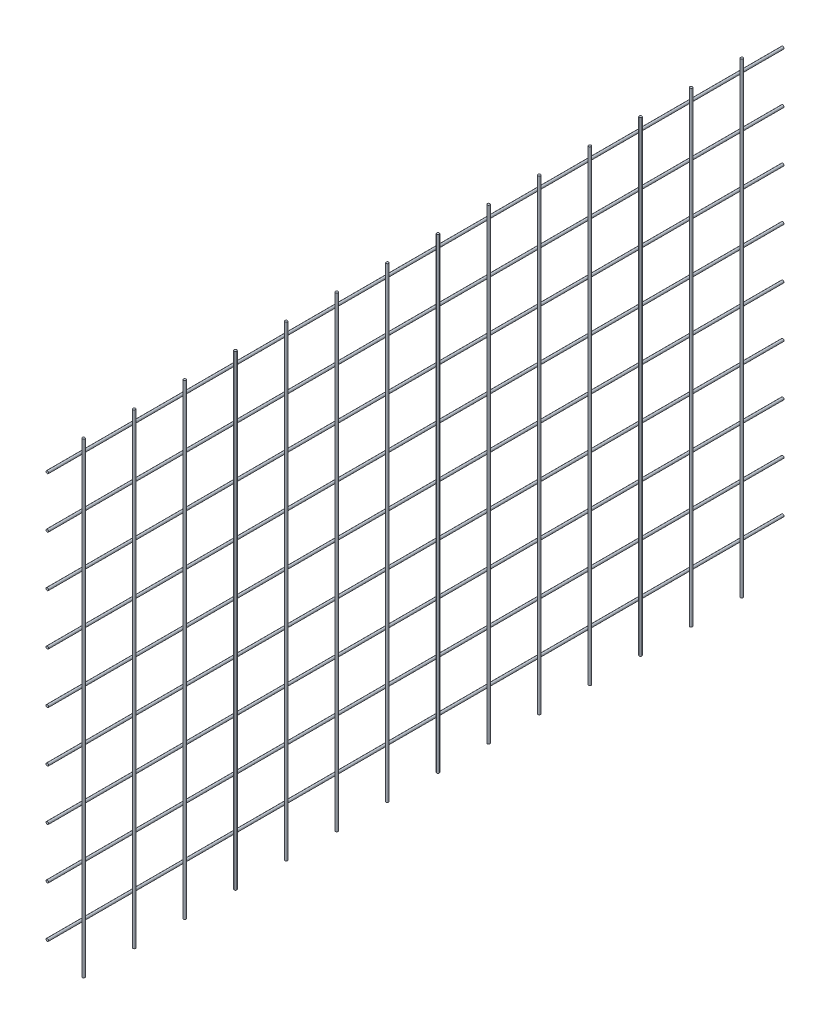
ISO-10303-21;
HEADER;
FILE_DESCRIPTION(('STEP AP214'),'2;1');
FILE_NAME('part.step','',(''),(''),'','','');
FILE_SCHEMA(('AUTOMOTIVE_DESIGN { 1 0 10303 214 1 1 1 1 }'));
ENDSEC;
DATA;
#1=APPLICATION_CONTEXT('core data for automotive mechanical design processes');
#2=APPLICATION_PROTOCOL_DEFINITION('international standard','automotive_design',2000,#1);
#3=PRODUCT_CONTEXT('',#1,'mechanical');
#4=PRODUCT('Part','Part','',(#3));
#5=PRODUCT_RELATED_PRODUCT_CATEGORY('part','',(#4));
#6=PRODUCT_DEFINITION_FORMATION('','',#4);
#7=PRODUCT_DEFINITION_CONTEXT('part definition',#1,'design');
#8=PRODUCT_DEFINITION('design','',#6,#7);
#9=PRODUCT_DEFINITION_SHAPE('','',#8);
#10=(LENGTH_UNIT() NAMED_UNIT(*) SI_UNIT(.MILLI.,.METRE.));
#11=(NAMED_UNIT(*) PLANE_ANGLE_UNIT() SI_UNIT($,.RADIAN.));
#12=(NAMED_UNIT(*) SI_UNIT($,.STERADIAN.) SOLID_ANGLE_UNIT());
#13=UNCERTAINTY_MEASURE_WITH_UNIT(LENGTH_MEASURE(1.E-05),#10,'distance_accuracy_value','');
#14=(GEOMETRIC_REPRESENTATION_CONTEXT(3) GLOBAL_UNCERTAINTY_ASSIGNED_CONTEXT((#13)) GLOBAL_UNIT_ASSIGNED_CONTEXT((#10,
#11,#12)) REPRESENTATION_CONTEXT('',''));
#15=CARTESIAN_POINT('',(0.,0.,0.));
#16=DIRECTION('',(0.,0.,1.));
#17=DIRECTION('',(1.,0.,0.));
#18=AXIS2_PLACEMENT_3D('',#15,#16,#17);
#19=CARTESIAN_POINT('',(-20.0100000000104,703.5,-891.500000000004));
#20=DIRECTION('',(0.,0.,-1.));
#21=DIRECTION('',(-1.,0.,0.));
#22=AXIS2_PLACEMENT_3D('',#19,#20,#21);
#23=PLANE('',#22);
#24=CARTESIAN_POINT('',(0.,760.,-891.500000000004));
#25=DIRECTION('',(0.,0.,-1.));
#26=DIRECTION('',(-1.,0.,0.));
#27=AXIS2_PLACEMENT_3D('',#24,#25,#26);
#28=CIRCLE('',#27,1.49999999999986);
#29=CARTESIAN_POINT('',(-1.49999999999985,760.,-891.500000000004));
#30=VERTEX_POINT('',#29);
#31=EDGE_CURVE('E56',#30,#30,#28,.T.);
#32=ORIENTED_EDGE('',*,*,#31,.T.);
#33=EDGE_LOOP('',(#32));
#34=FACE_BOUND('',#33,.T.);
#35=ADVANCED_FACE('F52',(#34),#23,.T.);
#36=CARTESIAN_POINT('',(0.,760.,-20.));
#37=DIRECTION('',(0.,0.,-1.));
#38=DIRECTION('',(-1.,0.,0.));
#39=AXIS2_PLACEMENT_3D('',#36,#37,#38);
#40=PLANE('',#39);
#41=CARTESIAN_POINT('',(0.,760.,-20.));
#42=DIRECTION('',(0.,0.,-1.));
#43=DIRECTION('',(-1.,0.,0.));
#44=AXIS2_PLACEMENT_3D('',#41,#42,#43);
#45=CIRCLE('',#44,1.49999999999986);
#46=CARTESIAN_POINT('',(-1.49999999999985,760.,-20.));
#47=VERTEX_POINT('',#46);
#48=EDGE_CURVE('E11',#47,#47,#45,.T.);
#49=ORIENTED_EDGE('',*,*,#48,.F.);
#50=EDGE_LOOP('',(#49));
#51=FACE_BOUND('',#50,.T.);
#52=ADVANCED_FACE('F71',(#51),#40,.F.);
#53=CARTESIAN_POINT('',(0.,760.,-3080.002));
#54=DIRECTION('',(0.,0.,1.));
#55=DIRECTION('',(1.,0.,0.));
#56=AXIS2_PLACEMENT_3D('',#53,#54,#55);
#57=CYLINDRICAL_SURFACE('',#56,1.49999999999986);
#58=ORIENTED_EDGE('',*,*,#48,.T.);
#59=EDGE_LOOP('',(#58));
#60=FACE_BOUND('',#59,.T.);
#61=ORIENTED_EDGE('',*,*,#31,.F.);
#62=EDGE_LOOP('',(#61));
#63=FACE_BOUND('',#62,.T.);
#64=ADVANCED_FACE('F54',(#60,#63),#57,.T.);
#65=CLOSED_SHELL('',(#35,#52,#64));
#66=MANIFOLD_SOLID_BREP('B2',#65);
#67=CARTESIAN_POINT('',(-20.0100000000104,703.5,-891.500000000004));
#68=DIRECTION('',(0.,0.,-1.));
#69=DIRECTION('',(-1.,0.,0.));
#70=AXIS2_PLACEMENT_3D('',#67,#68,#69);
#71=PLANE('',#70);
#72=CARTESIAN_POINT('',(-1.06451306103317E-11,820.,-891.500000000004));
#73=DIRECTION('',(0.,0.,-1.));
#74=DIRECTION('',(-1.,0.,0.));
#75=AXIS2_PLACEMENT_3D('',#72,#73,#74);
#76=CIRCLE('',#75,1.49999999999986);
#77=CARTESIAN_POINT('',(-1.50000000001051,820.,-891.500000000004));
#78=VERTEX_POINT('',#77);
#79=EDGE_CURVE('E103',#78,#78,#76,.T.);
#80=ORIENTED_EDGE('',*,*,#79,.T.);
#81=EDGE_LOOP('',(#80));
#82=FACE_BOUND('',#81,.T.);
#83=ADVANCED_FACE('F99',(#82),#71,.T.);
#84=CARTESIAN_POINT('',(-1.06451306103317E-11,820.,-20.));
#85=DIRECTION('',(0.,0.,-1.));
#86=DIRECTION('',(-1.,0.,0.));
#87=AXIS2_PLACEMENT_3D('',#84,#85,#86);
#88=PLANE('',#87);
#89=CARTESIAN_POINT('',(-1.06451306103317E-11,820.,-20.));
#90=DIRECTION('',(0.,0.,-1.));
#91=DIRECTION('',(-1.,0.,0.));
#92=AXIS2_PLACEMENT_3D('',#89,#90,#91);
#93=CIRCLE('',#92,1.49999999999986);
#94=CARTESIAN_POINT('',(-1.50000000001051,820.,-20.));
#95=VERTEX_POINT('',#94);
#96=EDGE_CURVE('E51',#95,#95,#93,.T.);
#97=ORIENTED_EDGE('',*,*,#96,.F.);
#98=EDGE_LOOP('',(#97));
#99=FACE_BOUND('',#98,.T.);
#100=ADVANCED_FACE('F118',(#99),#88,.F.);
#101=CARTESIAN_POINT('',(0.,820.,-3080.002));
#102=DIRECTION('',(0.,0.,1.));
#103=DIRECTION('',(1.,0.,0.));
#104=AXIS2_PLACEMENT_3D('',#101,#102,#103);
#105=CYLINDRICAL_SURFACE('',#104,1.49999999999986);
#106=ORIENTED_EDGE('',*,*,#96,.T.);
#107=EDGE_LOOP('',(#106));
#108=FACE_BOUND('',#107,.T.);
#109=ORIENTED_EDGE('',*,*,#79,.F.);
#110=EDGE_LOOP('',(#109));
#111=FACE_BOUND('',#110,.T.);
#112=ADVANCED_FACE('F101',(#108,#111),#105,.T.);
#113=CLOSED_SHELL('',(#83,#100,#112));
#114=MANIFOLD_SOLID_BREP('B6',#113);
#115=CARTESIAN_POINT('',(-20.0100000000104,703.5,-891.500000000004));
#116=DIRECTION('',(0.,0.,-1.));
#117=DIRECTION('',(-1.,0.,0.));
#118=AXIS2_PLACEMENT_3D('',#115,#116,#117);
#119=PLANE('',#118);
#120=CARTESIAN_POINT('',(0.,880.,-891.500000000004));
#121=DIRECTION('',(0.,0.,-1.));
#122=DIRECTION('',(-1.,0.,0.));
#123=AXIS2_PLACEMENT_3D('',#120,#121,#122);
#124=CIRCLE('',#123,1.49999999999986);
#125=CARTESIAN_POINT('',(-1.49999999999985,880.,-891.500000000004));
#126=VERTEX_POINT('',#125);
#127=EDGE_CURVE('E150',#126,#126,#124,.T.);
#128=ORIENTED_EDGE('',*,*,#127,.T.);
#129=EDGE_LOOP('',(#128));
#130=FACE_BOUND('',#129,.T.);
#131=ADVANCED_FACE('F146',(#130),#119,.T.);
#132=CARTESIAN_POINT('',(0.,880.,-20.));
#133=DIRECTION('',(0.,0.,-1.));
#134=DIRECTION('',(-1.,0.,0.));
#135=AXIS2_PLACEMENT_3D('',#132,#133,#134);
#136=PLANE('',#135);
#137=CARTESIAN_POINT('',(0.,880.,-20.));
#138=DIRECTION('',(0.,0.,-1.));
#139=DIRECTION('',(-1.,0.,0.));
#140=AXIS2_PLACEMENT_3D('',#137,#138,#139);
#141=CIRCLE('',#140,1.49999999999986);
#142=CARTESIAN_POINT('',(-1.49999999999985,880.,-20.));
#143=VERTEX_POINT('',#142);
#144=EDGE_CURVE('E98',#143,#143,#141,.T.);
#145=ORIENTED_EDGE('',*,*,#144,.F.);
#146=EDGE_LOOP('',(#145));
#147=FACE_BOUND('',#146,.T.);
#148=ADVANCED_FACE('F165',(#147),#136,.F.);
#149=CARTESIAN_POINT('',(0.,880.,-3080.002));
#150=DIRECTION('',(0.,0.,1.));
#151=DIRECTION('',(1.,0.,0.));
#152=AXIS2_PLACEMENT_3D('',#149,#150,#151);
#153=CYLINDRICAL_SURFACE('',#152,1.49999999999986);
#154=ORIENTED_EDGE('',*,*,#144,.T.);
#155=EDGE_LOOP('',(#154));
#156=FACE_BOUND('',#155,.T.);
#157=ORIENTED_EDGE('',*,*,#127,.F.);
#158=EDGE_LOOP('',(#157));
#159=FACE_BOUND('',#158,.T.);
#160=ADVANCED_FACE('F148',(#156,#159),#153,.T.);
#161=CLOSED_SHELL('',(#131,#148,#160));
#162=MANIFOLD_SOLID_BREP('B46',#161);
#163=CARTESIAN_POINT('',(-20.0100000000104,703.5,-891.500000000004));
#164=DIRECTION('',(0.,0.,-1.));
#165=DIRECTION('',(-1.,0.,0.));
#166=AXIS2_PLACEMENT_3D('',#163,#164,#165);
#167=PLANE('',#166);
#168=CARTESIAN_POINT('',(-1.06451306103317E-11,940.,-891.500000000004));
#169=DIRECTION('',(0.,0.,-1.));
#170=DIRECTION('',(-1.,0.,0.));
#171=AXIS2_PLACEMENT_3D('',#168,#169,#170);
#172=CIRCLE('',#171,1.49999999999986);
#173=CARTESIAN_POINT('',(-1.50000000001051,940.,-891.500000000004));
#174=VERTEX_POINT('',#173);
#175=EDGE_CURVE('E197',#174,#174,#172,.T.);
#176=ORIENTED_EDGE('',*,*,#175,.T.);
#177=EDGE_LOOP('',(#176));
#178=FACE_BOUND('',#177,.T.);
#179=ADVANCED_FACE('F193',(#178),#167,.T.);
#180=CARTESIAN_POINT('',(-1.06451306103317E-11,940.,-20.));
#181=DIRECTION('',(0.,0.,-1.));
#182=DIRECTION('',(-1.,0.,0.));
#183=AXIS2_PLACEMENT_3D('',#180,#181,#182);
#184=PLANE('',#183);
#185=CARTESIAN_POINT('',(-1.06451306103317E-11,940.,-20.));
#186=DIRECTION('',(0.,0.,-1.));
#187=DIRECTION('',(-1.,0.,0.));
#188=AXIS2_PLACEMENT_3D('',#185,#186,#187);
#189=CIRCLE('',#188,1.49999999999986);
#190=CARTESIAN_POINT('',(-1.50000000001051,940.,-20.));
#191=VERTEX_POINT('',#190);
#192=EDGE_CURVE('E145',#191,#191,#189,.T.);
#193=ORIENTED_EDGE('',*,*,#192,.F.);
#194=EDGE_LOOP('',(#193));
#195=FACE_BOUND('',#194,.T.);
#196=ADVANCED_FACE('F212',(#195),#184,.F.);
#197=CARTESIAN_POINT('',(0.,940.,-3080.002));
#198=DIRECTION('',(0.,0.,1.));
#199=DIRECTION('',(1.,0.,0.));
#200=AXIS2_PLACEMENT_3D('',#197,#198,#199);
#201=CYLINDRICAL_SURFACE('',#200,1.49999999999986);
#202=ORIENTED_EDGE('',*,*,#192,.T.);
#203=EDGE_LOOP('',(#202));
#204=FACE_BOUND('',#203,.T.);
#205=ORIENTED_EDGE('',*,*,#175,.F.);
#206=EDGE_LOOP('',(#205));
#207=FACE_BOUND('',#206,.T.);
#208=ADVANCED_FACE('F195',(#204,#207),#201,.T.);
#209=CLOSED_SHELL('',(#179,#196,#208));
#210=MANIFOLD_SOLID_BREP('B93',#209);
#211=CARTESIAN_POINT('',(-20.0100000000104,703.5,-891.500000000004));
#212=DIRECTION('',(0.,0.,-1.));
#213=DIRECTION('',(-1.,0.,0.));
#214=AXIS2_PLACEMENT_3D('',#211,#212,#213);
#215=PLANE('',#214);
#216=CARTESIAN_POINT('',(0.,1000.,-891.500000000004));
#217=DIRECTION('',(0.,0.,-1.));
#218=DIRECTION('',(-1.,0.,0.));
#219=AXIS2_PLACEMENT_3D('',#216,#217,#218);
#220=CIRCLE('',#219,1.49999999999986);
#221=CARTESIAN_POINT('',(-1.49999999999986,1000.,-891.500000000004));
#222=VERTEX_POINT('',#221);
#223=EDGE_CURVE('E244',#222,#222,#220,.T.);
#224=ORIENTED_EDGE('',*,*,#223,.T.);
#225=EDGE_LOOP('',(#224));
#226=FACE_BOUND('',#225,.T.);
#227=ADVANCED_FACE('F240',(#226),#215,.T.);
#228=CARTESIAN_POINT('',(0.,1000.,-20.));
#229=DIRECTION('',(0.,0.,-1.));
#230=DIRECTION('',(-1.,0.,0.));
#231=AXIS2_PLACEMENT_3D('',#228,#229,#230);
#232=PLANE('',#231);
#233=CARTESIAN_POINT('',(0.,1000.,-20.));
#234=DIRECTION('',(0.,0.,-1.));
#235=DIRECTION('',(-1.,0.,0.));
#236=AXIS2_PLACEMENT_3D('',#233,#234,#235);
#237=CIRCLE('',#236,1.49999999999986);
#238=CARTESIAN_POINT('',(-1.49999999999986,1000.,-20.));
#239=VERTEX_POINT('',#238);
#240=EDGE_CURVE('E192',#239,#239,#237,.T.);
#241=ORIENTED_EDGE('',*,*,#240,.F.);
#242=EDGE_LOOP('',(#241));
#243=FACE_BOUND('',#242,.T.);
#244=ADVANCED_FACE('F260',(#243),#232,.F.);
#245=CARTESIAN_POINT('',(0.,1000.,-3080.002));
#246=DIRECTION('',(0.,0.,1.));
#247=DIRECTION('',(1.,0.,0.));
#248=AXIS2_PLACEMENT_3D('',#245,#246,#247);
#249=CYLINDRICAL_SURFACE('',#248,1.49999999999986);
#250=ORIENTED_EDGE('',*,*,#240,.T.);
#251=EDGE_LOOP('',(#250));
#252=FACE_BOUND('',#251,.T.);
#253=ORIENTED_EDGE('',*,*,#223,.F.);
#254=EDGE_LOOP('',(#253));
#255=FACE_BOUND('',#254,.T.);
#256=ADVANCED_FACE('F242',(#252,#255),#249,.T.);
#257=CLOSED_SHELL('',(#227,#244,#256));
#258=MANIFOLD_SOLID_BREP('B140',#257);
#259=CARTESIAN_POINT('',(-20.0100000000104,703.5,-891.500000000004));
#260=DIRECTION('',(0.,0.,-1.));
#261=DIRECTION('',(-1.,0.,0.));
#262=AXIS2_PLACEMENT_3D('',#259,#260,#261);
#263=PLANE('',#262);
#264=CARTESIAN_POINT('',(-1.06581410364015E-11,1060.,-891.500000000004));
#265=DIRECTION('',(0.,0.,-1.));
#266=DIRECTION('',(-1.,0.,0.));
#267=AXIS2_PLACEMENT_3D('',#264,#265,#266);
#268=CIRCLE('',#267,1.49999999999986);
#269=CARTESIAN_POINT('',(-1.50000000001052,1060.,-891.500000000004));
#270=VERTEX_POINT('',#269);
#271=EDGE_CURVE('E292',#270,#270,#268,.T.);
#272=ORIENTED_EDGE('',*,*,#271,.T.);
#273=EDGE_LOOP('',(#272));
#274=FACE_BOUND('',#273,.T.);
#275=ADVANCED_FACE('F288',(#274),#263,.T.);
#276=CARTESIAN_POINT('',(-1.06581410364015E-11,1060.,-20.));
#277=DIRECTION('',(0.,0.,-1.));
#278=DIRECTION('',(-1.,0.,0.));
#279=AXIS2_PLACEMENT_3D('',#276,#277,#278);
#280=PLANE('',#279);
#281=CARTESIAN_POINT('',(-1.06581410364015E-11,1060.,-20.));
#282=DIRECTION('',(0.,0.,-1.));
#283=DIRECTION('',(-1.,0.,0.));
#284=AXIS2_PLACEMENT_3D('',#281,#282,#283);
#285=CIRCLE('',#284,1.49999999999986);
#286=CARTESIAN_POINT('',(-1.50000000001052,1060.,-20.));
#287=VERTEX_POINT('',#286);
#288=EDGE_CURVE('E239',#287,#287,#285,.T.);
#289=ORIENTED_EDGE('',*,*,#288,.F.);
#290=EDGE_LOOP('',(#289));
#291=FACE_BOUND('',#290,.T.);
#292=ADVANCED_FACE('F308',(#291),#280,.F.);
#293=CARTESIAN_POINT('',(0.,1060.,-3080.002));
#294=DIRECTION('',(0.,0.,1.));
#295=DIRECTION('',(1.,0.,0.));
#296=AXIS2_PLACEMENT_3D('',#293,#294,#295);
#297=CYLINDRICAL_SURFACE('',#296,1.49999999999986);
#298=ORIENTED_EDGE('',*,*,#288,.T.);
#299=EDGE_LOOP('',(#298));
#300=FACE_BOUND('',#299,.T.);
#301=ORIENTED_EDGE('',*,*,#271,.F.);
#302=EDGE_LOOP('',(#301));
#303=FACE_BOUND('',#302,.T.);
#304=ADVANCED_FACE('F290',(#300,#303),#297,.T.);
#305=CLOSED_SHELL('',(#275,#292,#304));
#306=MANIFOLD_SOLID_BREP('B187',#305);
#307=CARTESIAN_POINT('',(-20.0100000000104,703.5,-891.500000000004));
#308=DIRECTION('',(0.,0.,-1.));
#309=DIRECTION('',(-1.,0.,0.));
#310=AXIS2_PLACEMENT_3D('',#307,#308,#309);
#311=PLANE('',#310);
#312=CARTESIAN_POINT('',(0.,1120.,-891.500000000004));
#313=DIRECTION('',(0.,0.,-1.));
#314=DIRECTION('',(-1.,0.,0.));
#315=AXIS2_PLACEMENT_3D('',#312,#313,#314);
#316=CIRCLE('',#315,1.49999999999986);
#317=CARTESIAN_POINT('',(-1.49999999999986,1120.,-891.500000000004));
#318=VERTEX_POINT('',#317);
#319=EDGE_CURVE('E340',#318,#318,#316,.T.);
#320=ORIENTED_EDGE('',*,*,#319,.T.);
#321=EDGE_LOOP('',(#320));
#322=FACE_BOUND('',#321,.T.);
#323=ADVANCED_FACE('F336',(#322),#311,.T.);
#324=CARTESIAN_POINT('',(-1.06581410364015E-11,1120.,-20.));
#325=DIRECTION('',(0.,0.,-1.));
#326=DIRECTION('',(-1.,0.,0.));
#327=AXIS2_PLACEMENT_3D('',#324,#325,#326);
#328=PLANE('',#327);
#329=CARTESIAN_POINT('',(-1.06581410364015E-11,1120.,-20.));
#330=DIRECTION('',(0.,0.,-1.));
#331=DIRECTION('',(-1.,0.,0.));
#332=AXIS2_PLACEMENT_3D('',#329,#330,#331);
#333=CIRCLE('',#332,1.49999999999986);
#334=CARTESIAN_POINT('',(-1.50000000001052,1120.,-20.));
#335=VERTEX_POINT('',#334);
#336=EDGE_CURVE('E287',#335,#335,#333,.T.);
#337=ORIENTED_EDGE('',*,*,#336,.F.);
#338=EDGE_LOOP('',(#337));
#339=FACE_BOUND('',#338,.T.);
#340=ADVANCED_FACE('F356',(#339),#328,.F.);
#341=CARTESIAN_POINT('',(0.,1120.,-3080.002));
#342=DIRECTION('',(0.,0.,1.));
#343=DIRECTION('',(1.,0.,0.));
#344=AXIS2_PLACEMENT_3D('',#341,#342,#343);
#345=CYLINDRICAL_SURFACE('',#344,1.49999999999986);
#346=ORIENTED_EDGE('',*,*,#336,.T.);
#347=EDGE_LOOP('',(#346));
#348=FACE_BOUND('',#347,.T.);
#349=ORIENTED_EDGE('',*,*,#319,.F.);
#350=EDGE_LOOP('',(#349));
#351=FACE_BOUND('',#350,.T.);
#352=ADVANCED_FACE('F338',(#348,#351),#345,.T.);
#353=CLOSED_SHELL('',(#323,#340,#352));
#354=MANIFOLD_SOLID_BREP('B234',#353);
#355=CARTESIAN_POINT('',(-20.0100000000104,703.5,-891.500000000004));
#356=DIRECTION('',(0.,0.,-1.));
#357=DIRECTION('',(-1.,0.,0.));
#358=AXIS2_PLACEMENT_3D('',#355,#356,#357);
#359=PLANE('',#358);
#360=CARTESIAN_POINT('',(-1.06581410364015E-11,1180.,-891.500000000004));
#361=DIRECTION('',(0.,0.,-1.));
#362=DIRECTION('',(-1.,0.,0.));
#363=AXIS2_PLACEMENT_3D('',#360,#361,#362);
#364=CIRCLE('',#363,1.49999999999986);
#365=CARTESIAN_POINT('',(-1.50000000001052,1180.,-891.500000000004));
#366=VERTEX_POINT('',#365);
#367=EDGE_CURVE('E388',#366,#366,#364,.T.);
#368=ORIENTED_EDGE('',*,*,#367,.T.);
#369=EDGE_LOOP('',(#368));
#370=FACE_BOUND('',#369,.T.);
#371=ADVANCED_FACE('F384',(#370),#359,.T.);
#372=CARTESIAN_POINT('',(-1.06581410364015E-11,1180.,-20.));
#373=DIRECTION('',(0.,0.,-1.));
#374=DIRECTION('',(-1.,0.,0.));
#375=AXIS2_PLACEMENT_3D('',#372,#373,#374);
#376=PLANE('',#375);
#377=CARTESIAN_POINT('',(-1.06581410364015E-11,1180.,-20.));
#378=DIRECTION('',(0.,0.,-1.));
#379=DIRECTION('',(-1.,0.,0.));
#380=AXIS2_PLACEMENT_3D('',#377,#378,#379);
#381=CIRCLE('',#380,1.49999999999986);
#382=CARTESIAN_POINT('',(-1.50000000001052,1180.,-20.));
#383=VERTEX_POINT('',#382);
#384=EDGE_CURVE('E335',#383,#383,#381,.T.);
#385=ORIENTED_EDGE('',*,*,#384,.F.);
#386=EDGE_LOOP('',(#385));
#387=FACE_BOUND('',#386,.T.);
#388=ADVANCED_FACE('F403',(#387),#376,.F.);
#389=CARTESIAN_POINT('',(0.,1180.,-3080.002));
#390=DIRECTION('',(0.,0.,1.));
#391=DIRECTION('',(1.,0.,0.));
#392=AXIS2_PLACEMENT_3D('',#389,#390,#391);
#393=CYLINDRICAL_SURFACE('',#392,1.49999999999986);
#394=ORIENTED_EDGE('',*,*,#384,.T.);
#395=EDGE_LOOP('',(#394));
#396=FACE_BOUND('',#395,.T.);
#397=ORIENTED_EDGE('',*,*,#367,.F.);
#398=EDGE_LOOP('',(#397));
#399=FACE_BOUND('',#398,.T.);
#400=ADVANCED_FACE('F386',(#396,#399),#393,.T.);
#401=CLOSED_SHELL('',(#371,#388,#400));
#402=MANIFOLD_SOLID_BREP('B282',#401);
#403=CARTESIAN_POINT('',(-20.0100000000104,703.5,-891.500000000004));
#404=DIRECTION('',(0.,0.,-1.));
#405=DIRECTION('',(-1.,0.,0.));
#406=AXIS2_PLACEMENT_3D('',#403,#404,#405);
#407=PLANE('',#406);
#408=CARTESIAN_POINT('',(0.,1240.,-891.500000000004));
#409=DIRECTION('',(0.,0.,-1.));
#410=DIRECTION('',(-1.,0.,0.));
#411=AXIS2_PLACEMENT_3D('',#408,#409,#410);
#412=CIRCLE('',#411,1.49999999999986);
#413=CARTESIAN_POINT('',(-1.49999999999986,1240.,-891.500000000004));
#414=VERTEX_POINT('',#413);
#415=EDGE_CURVE('E435',#414,#414,#412,.T.);
#416=ORIENTED_EDGE('',*,*,#415,.T.);
#417=EDGE_LOOP('',(#416));
#418=FACE_BOUND('',#417,.T.);
#419=ADVANCED_FACE('F431',(#418),#407,.T.);
#420=CARTESIAN_POINT('',(-1.06581410364015E-11,1240.,-20.));
#421=DIRECTION('',(0.,0.,-1.));
#422=DIRECTION('',(-1.,0.,0.));
#423=AXIS2_PLACEMENT_3D('',#420,#421,#422);
#424=PLANE('',#423);
#425=CARTESIAN_POINT('',(-1.06581410364015E-11,1240.,-20.));
#426=DIRECTION('',(0.,0.,-1.));
#427=DIRECTION('',(-1.,0.,0.));
#428=AXIS2_PLACEMENT_3D('',#425,#426,#427);
#429=CIRCLE('',#428,1.49999999999986);
#430=CARTESIAN_POINT('',(-1.50000000001052,1240.,-20.));
#431=VERTEX_POINT('',#430);
#432=EDGE_CURVE('E383',#431,#431,#429,.T.);
#433=ORIENTED_EDGE('',*,*,#432,.F.);
#434=EDGE_LOOP('',(#433));
#435=FACE_BOUND('',#434,.T.);
#436=ADVANCED_FACE('F450',(#435),#424,.F.);
#437=CARTESIAN_POINT('',(0.,1240.,-3080.002));
#438=DIRECTION('',(0.,0.,1.));
#439=DIRECTION('',(1.,0.,0.));
#440=AXIS2_PLACEMENT_3D('',#437,#438,#439);
#441=CYLINDRICAL_SURFACE('',#440,1.49999999999986);
#442=ORIENTED_EDGE('',*,*,#432,.T.);
#443=EDGE_LOOP('',(#442));
#444=FACE_BOUND('',#443,.T.);
#445=ORIENTED_EDGE('',*,*,#415,.F.);
#446=EDGE_LOOP('',(#445));
#447=FACE_BOUND('',#446,.T.);
#448=ADVANCED_FACE('F433',(#444,#447),#441,.T.);
#449=CLOSED_SHELL('',(#419,#436,#448));
#450=MANIFOLD_SOLID_BREP('B330',#449);
#451=CARTESIAN_POINT('',(-20.0100000000108,703.5,-20.0000000000067));
#452=DIRECTION('',(0.,-1.,0.));
#453=DIRECTION('',(0.,0.,-1.));
#454=AXIS2_PLACEMENT_3D('',#451,#452,#453);
#455=PLANE('',#454);
#456=CARTESIAN_POINT('',(2.9999999999948,703.5,-840.000000000003));
#457=DIRECTION('',(0.,-1.,0.));
#458=DIRECTION('',(0.,0.,-1.));
#459=AXIS2_PLACEMENT_3D('',#456,#457,#458);
#460=CIRCLE('',#459,1.5);
#461=CARTESIAN_POINT('',(2.9999999999948,703.5,-841.500000000003));
#462=VERTEX_POINT('',#461);
#463=EDGE_CURVE('E430',#462,#462,#460,.T.);
#464=ORIENTED_EDGE('',*,*,#463,.T.);
#465=EDGE_LOOP('',(#464));
#466=FACE_BOUND('',#465,.T.);
#467=ADVANCED_FACE('F478',(#466),#455,.T.);
#468=CARTESIAN_POINT('',(-20.0100000000001,1256.49999999999,-20.));
#469=DIRECTION('',(0.,1.,0.));
#470=DIRECTION('',(0.,0.,1.));
#471=AXIS2_PLACEMENT_3D('',#468,#469,#470);
#472=PLANE('',#471);
#473=CARTESIAN_POINT('',(3.000000000005,1256.5,-840.000000000003));
#474=DIRECTION('',(0.,1.,0.));
#475=DIRECTION('',(0.,0.,1.));
#476=AXIS2_PLACEMENT_3D('',#473,#474,#475);
#477=CIRCLE('',#476,1.5);
#478=CARTESIAN_POINT('',(3.00000000000499,1256.5,-838.500000000003));
#479=VERTEX_POINT('',#478);
#480=EDGE_CURVE('E486',#479,#479,#477,.T.);
#481=ORIENTED_EDGE('',*,*,#480,.T.);
#482=EDGE_LOOP('',(#481));
#483=FACE_BOUND('',#482,.T.);
#484=ADVANCED_FACE('F495',(#483),#472,.T.);
#485=CARTESIAN_POINT('',(2.9999999999948,1980.002,-840.));
#486=DIRECTION('',(0.,-1.,0.));
#487=DIRECTION('',(0.,0.,-1.));
#488=AXIS2_PLACEMENT_3D('',#485,#486,#487);
#489=CYLINDRICAL_SURFACE('',#488,1.5);
#490=ORIENTED_EDGE('',*,*,#480,.F.);
#491=EDGE_LOOP('',(#490));
#492=FACE_BOUND('',#491,.T.);
#493=ORIENTED_EDGE('',*,*,#463,.F.);
#494=EDGE_LOOP('',(#493));
#495=FACE_BOUND('',#494,.T.);
#496=ADVANCED_FACE('F480',(#492,#495),#489,.T.);
#497=CLOSED_SHELL('',(#467,#484,#496));
#498=MANIFOLD_SOLID_BREP('B378',#497);
#499=CARTESIAN_POINT('',(-20.0100000000108,703.5,-20.0000000000067));
#500=DIRECTION('',(0.,-1.,0.));
#501=DIRECTION('',(0.,0.,-1.));
#502=AXIS2_PLACEMENT_3D('',#499,#500,#501);
#503=PLANE('',#502);
#504=CARTESIAN_POINT('',(2.9999999999948,703.5,-780.000000000003));
#505=DIRECTION('',(0.,-1.,0.));
#506=DIRECTION('',(0.,0.,-1.));
#507=AXIS2_PLACEMENT_3D('',#504,#505,#506);
#508=CIRCLE('',#507,1.5);
#509=CARTESIAN_POINT('',(2.9999999999948,703.5,-781.500000000003));
#510=VERTEX_POINT('',#509);
#511=EDGE_CURVE('E477',#510,#510,#508,.T.);
#512=ORIENTED_EDGE('',*,*,#511,.T.);
#513=EDGE_LOOP('',(#512));
#514=FACE_BOUND('',#513,.T.);
#515=ADVANCED_FACE('F525',(#514),#503,.T.);
#516=CARTESIAN_POINT('',(-20.0100000000001,1256.49999999999,-20.));
#517=DIRECTION('',(0.,1.,0.));
#518=DIRECTION('',(0.,0.,1.));
#519=AXIS2_PLACEMENT_3D('',#516,#517,#518);
#520=PLANE('',#519);
#521=CARTESIAN_POINT('',(3.000000000005,1256.5,-780.000000000003));
#522=DIRECTION('',(0.,1.,0.));
#523=DIRECTION('',(0.,0.,1.));
#524=AXIS2_PLACEMENT_3D('',#521,#522,#523);
#525=CIRCLE('',#524,1.5);
#526=CARTESIAN_POINT('',(3.00000000000499,1256.5,-778.500000000003));
#527=VERTEX_POINT('',#526);
#528=EDGE_CURVE('E533',#527,#527,#525,.T.);
#529=ORIENTED_EDGE('',*,*,#528,.T.);
#530=EDGE_LOOP('',(#529));
#531=FACE_BOUND('',#530,.T.);
#532=ADVANCED_FACE('F542',(#531),#520,.T.);
#533=CARTESIAN_POINT('',(2.9999999999948,1980.002,-780.));
#534=DIRECTION('',(0.,-1.,0.));
#535=DIRECTION('',(0.,0.,-1.));
#536=AXIS2_PLACEMENT_3D('',#533,#534,#535);
#537=CYLINDRICAL_SURFACE('',#536,1.5);
#538=ORIENTED_EDGE('',*,*,#528,.F.);
#539=EDGE_LOOP('',(#538));
#540=FACE_BOUND('',#539,.T.);
#541=ORIENTED_EDGE('',*,*,#511,.F.);
#542=EDGE_LOOP('',(#541));
#543=FACE_BOUND('',#542,.T.);
#544=ADVANCED_FACE('F527',(#540,#543),#537,.T.);
#545=CLOSED_SHELL('',(#515,#532,#544));
#546=MANIFOLD_SOLID_BREP('B425',#545);
#547=CARTESIAN_POINT('',(-20.0100000000108,703.5,-20.0000000000067));
#548=DIRECTION('',(0.,-1.,0.));
#549=DIRECTION('',(0.,0.,-1.));
#550=AXIS2_PLACEMENT_3D('',#547,#548,#549);
#551=PLANE('',#550);
#552=CARTESIAN_POINT('',(2.9999999999948,703.5,-720.000000000003));
#553=DIRECTION('',(0.,-1.,0.));
#554=DIRECTION('',(0.,0.,-1.));
#555=AXIS2_PLACEMENT_3D('',#552,#553,#554);
#556=CIRCLE('',#555,1.5);
#557=CARTESIAN_POINT('',(2.9999999999948,703.5,-721.500000000003));
#558=VERTEX_POINT('',#557);
#559=EDGE_CURVE('E524',#558,#558,#556,.T.);
#560=ORIENTED_EDGE('',*,*,#559,.T.);
#561=EDGE_LOOP('',(#560));
#562=FACE_BOUND('',#561,.T.);
#563=ADVANCED_FACE('F572',(#562),#551,.T.);
#564=CARTESIAN_POINT('',(-20.0100000000001,1256.49999999999,-20.));
#565=DIRECTION('',(0.,1.,0.));
#566=DIRECTION('',(0.,0.,1.));
#567=AXIS2_PLACEMENT_3D('',#564,#565,#566);
#568=PLANE('',#567);
#569=CARTESIAN_POINT('',(3.000000000005,1256.5,-720.000000000003));
#570=DIRECTION('',(0.,1.,0.));
#571=DIRECTION('',(0.,0.,1.));
#572=AXIS2_PLACEMENT_3D('',#569,#570,#571);
#573=CIRCLE('',#572,1.5);
#574=CARTESIAN_POINT('',(3.00000000000499,1256.5,-718.500000000003));
#575=VERTEX_POINT('',#574);
#576=EDGE_CURVE('E580',#575,#575,#573,.T.);
#577=ORIENTED_EDGE('',*,*,#576,.T.);
#578=EDGE_LOOP('',(#577));
#579=FACE_BOUND('',#578,.T.);
#580=ADVANCED_FACE('F589',(#579),#568,.T.);
#581=CARTESIAN_POINT('',(2.9999999999948,1980.002,-720.));
#582=DIRECTION('',(0.,-1.,0.));
#583=DIRECTION('',(0.,0.,-1.));
#584=AXIS2_PLACEMENT_3D('',#581,#582,#583);
#585=CYLINDRICAL_SURFACE('',#584,1.5);
#586=ORIENTED_EDGE('',*,*,#576,.F.);
#587=EDGE_LOOP('',(#586));
#588=FACE_BOUND('',#587,.T.);
#589=ORIENTED_EDGE('',*,*,#559,.F.);
#590=EDGE_LOOP('',(#589));
#591=FACE_BOUND('',#590,.T.);
#592=ADVANCED_FACE('F574',(#588,#591),#585,.T.);
#593=CLOSED_SHELL('',(#563,#580,#592));
#594=MANIFOLD_SOLID_BREP('B472',#593);
#595=CARTESIAN_POINT('',(-20.0100000000108,703.5,-20.0000000000067));
#596=DIRECTION('',(0.,-1.,0.));
#597=DIRECTION('',(0.,0.,-1.));
#598=AXIS2_PLACEMENT_3D('',#595,#596,#597);
#599=PLANE('',#598);
#600=CARTESIAN_POINT('',(2.9999999999948,703.5,-660.000000000003));
#601=DIRECTION('',(0.,-1.,0.));
#602=DIRECTION('',(0.,0.,-1.));
#603=AXIS2_PLACEMENT_3D('',#600,#601,#602);
#604=CIRCLE('',#603,1.5);
#605=CARTESIAN_POINT('',(2.9999999999948,703.5,-661.500000000003));
#606=VERTEX_POINT('',#605);
#607=EDGE_CURVE('E571',#606,#606,#604,.T.);
#608=ORIENTED_EDGE('',*,*,#607,.T.);
#609=EDGE_LOOP('',(#608));
#610=FACE_BOUND('',#609,.T.);
#611=ADVANCED_FACE('F619',(#610),#599,.T.);
#612=CARTESIAN_POINT('',(-20.0100000000001,1256.49999999999,-20.));
#613=DIRECTION('',(0.,1.,0.));
#614=DIRECTION('',(0.,0.,1.));
#615=AXIS2_PLACEMENT_3D('',#612,#613,#614);
#616=PLANE('',#615);
#617=CARTESIAN_POINT('',(2.99999999999478,1256.5,-660.000000000003));
#618=DIRECTION('',(0.,1.,0.));
#619=DIRECTION('',(0.,0.,1.));
#620=AXIS2_PLACEMENT_3D('',#617,#618,#619);
#621=CIRCLE('',#620,1.5);
#622=CARTESIAN_POINT('',(2.99999999999478,1256.5,-658.500000000003));
#623=VERTEX_POINT('',#622);
#624=EDGE_CURVE('E627',#623,#623,#621,.T.);
#625=ORIENTED_EDGE('',*,*,#624,.T.);
#626=EDGE_LOOP('',(#625));
#627=FACE_BOUND('',#626,.T.);
#628=ADVANCED_FACE('F636',(#627),#616,.T.);
#629=CARTESIAN_POINT('',(2.9999999999948,1980.002,-660.));
#630=DIRECTION('',(0.,-1.,0.));
#631=DIRECTION('',(0.,0.,-1.));
#632=AXIS2_PLACEMENT_3D('',#629,#630,#631);
#633=CYLINDRICAL_SURFACE('',#632,1.5);
#634=ORIENTED_EDGE('',*,*,#624,.F.);
#635=EDGE_LOOP('',(#634));
#636=FACE_BOUND('',#635,.T.);
#637=ORIENTED_EDGE('',*,*,#607,.F.);
#638=EDGE_LOOP('',(#637));
#639=FACE_BOUND('',#638,.T.);
#640=ADVANCED_FACE('F621',(#636,#639),#633,.T.);
#641=CLOSED_SHELL('',(#611,#628,#640));
#642=MANIFOLD_SOLID_BREP('B519',#641);
#643=CARTESIAN_POINT('',(-20.0100000000108,703.5,-20.0000000000067));
#644=DIRECTION('',(0.,-1.,0.));
#645=DIRECTION('',(0.,0.,-1.));
#646=AXIS2_PLACEMENT_3D('',#643,#644,#645);
#647=PLANE('',#646);
#648=CARTESIAN_POINT('',(2.9999999999948,703.5,-600.000000000003));
#649=DIRECTION('',(0.,-1.,0.));
#650=DIRECTION('',(0.,0.,-1.));
#651=AXIS2_PLACEMENT_3D('',#648,#649,#650);
#652=CIRCLE('',#651,1.5);
#653=CARTESIAN_POINT('',(2.9999999999948,703.5,-601.500000000004));
#654=VERTEX_POINT('',#653);
#655=EDGE_CURVE('E618',#654,#654,#652,.T.);
#656=ORIENTED_EDGE('',*,*,#655,.T.);
#657=EDGE_LOOP('',(#656));
#658=FACE_BOUND('',#657,.T.);
#659=ADVANCED_FACE('F666',(#658),#647,.T.);
#660=CARTESIAN_POINT('',(-20.0100000000001,1256.49999999999,-20.));
#661=DIRECTION('',(0.,1.,0.));
#662=DIRECTION('',(0.,0.,1.));
#663=AXIS2_PLACEMENT_3D('',#660,#661,#662);
#664=PLANE('',#663);
#665=CARTESIAN_POINT('',(2.99999999999478,1256.5,-600.000000000003));
#666=DIRECTION('',(0.,1.,0.));
#667=DIRECTION('',(0.,0.,1.));
#668=AXIS2_PLACEMENT_3D('',#665,#666,#667);
#669=CIRCLE('',#668,1.5);
#670=CARTESIAN_POINT('',(2.99999999999478,1256.5,-598.500000000003));
#671=VERTEX_POINT('',#670);
#672=EDGE_CURVE('E674',#671,#671,#669,.T.);
#673=ORIENTED_EDGE('',*,*,#672,.T.);
#674=EDGE_LOOP('',(#673));
#675=FACE_BOUND('',#674,.T.);
#676=ADVANCED_FACE('F683',(#675),#664,.T.);
#677=CARTESIAN_POINT('',(2.9999999999948,1980.002,-600.));
#678=DIRECTION('',(0.,-1.,0.));
#679=DIRECTION('',(0.,0.,-1.));
#680=AXIS2_PLACEMENT_3D('',#677,#678,#679);
#681=CYLINDRICAL_SURFACE('',#680,1.5);
#682=ORIENTED_EDGE('',*,*,#672,.F.);
#683=EDGE_LOOP('',(#682));
#684=FACE_BOUND('',#683,.T.);
#685=ORIENTED_EDGE('',*,*,#655,.F.);
#686=EDGE_LOOP('',(#685));
#687=FACE_BOUND('',#686,.T.);
#688=ADVANCED_FACE('F668',(#684,#687),#681,.T.);
#689=CLOSED_SHELL('',(#659,#676,#688));
#690=MANIFOLD_SOLID_BREP('B566',#689);
#691=CARTESIAN_POINT('',(-20.0100000000108,703.5,-20.0000000000067));
#692=DIRECTION('',(0.,-1.,0.));
#693=DIRECTION('',(0.,0.,-1.));
#694=AXIS2_PLACEMENT_3D('',#691,#692,#693);
#695=PLANE('',#694);
#696=CARTESIAN_POINT('',(2.9999999999948,703.5,-540.000000000003));
#697=DIRECTION('',(0.,-1.,0.));
#698=DIRECTION('',(0.,0.,-1.));
#699=AXIS2_PLACEMENT_3D('',#696,#697,#698);
#700=CIRCLE('',#699,1.5);
#701=CARTESIAN_POINT('',(2.9999999999948,703.5,-541.500000000003));
#702=VERTEX_POINT('',#701);
#703=EDGE_CURVE('E665',#702,#702,#700,.T.);
#704=ORIENTED_EDGE('',*,*,#703,.T.);
#705=EDGE_LOOP('',(#704));
#706=FACE_BOUND('',#705,.T.);
#707=ADVANCED_FACE('F713',(#706),#695,.T.);
#708=CARTESIAN_POINT('',(-20.0100000000001,1256.49999999999,-20.));
#709=DIRECTION('',(0.,1.,0.));
#710=DIRECTION('',(0.,0.,1.));
#711=AXIS2_PLACEMENT_3D('',#708,#709,#710);
#712=PLANE('',#711);
#713=CARTESIAN_POINT('',(2.99999999999478,1256.5,-540.000000000003));
#714=DIRECTION('',(0.,1.,0.));
#715=DIRECTION('',(0.,0.,1.));
#716=AXIS2_PLACEMENT_3D('',#713,#714,#715);
#717=CIRCLE('',#716,1.5);
#718=CARTESIAN_POINT('',(2.99999999999478,1256.5,-538.500000000003));
#719=VERTEX_POINT('',#718);
#720=EDGE_CURVE('E721',#719,#719,#717,.T.);
#721=ORIENTED_EDGE('',*,*,#720,.T.);
#722=EDGE_LOOP('',(#721));
#723=FACE_BOUND('',#722,.T.);
#724=ADVANCED_FACE('F730',(#723),#712,.T.);
#725=CARTESIAN_POINT('',(2.9999999999948,1980.002,-540.));
#726=DIRECTION('',(0.,-1.,0.));
#727=DIRECTION('',(0.,0.,-1.));
#728=AXIS2_PLACEMENT_3D('',#725,#726,#727);
#729=CYLINDRICAL_SURFACE('',#728,1.5);
#730=ORIENTED_EDGE('',*,*,#720,.F.);
#731=EDGE_LOOP('',(#730));
#732=FACE_BOUND('',#731,.T.);
#733=ORIENTED_EDGE('',*,*,#703,.F.);
#734=EDGE_LOOP('',(#733));
#735=FACE_BOUND('',#734,.T.);
#736=ADVANCED_FACE('F715',(#732,#735),#729,.T.);
#737=CLOSED_SHELL('',(#707,#724,#736));
#738=MANIFOLD_SOLID_BREP('B613',#737);
#739=CARTESIAN_POINT('',(-20.0100000000108,703.5,-20.0000000000067));
#740=DIRECTION('',(0.,-1.,0.));
#741=DIRECTION('',(0.,0.,-1.));
#742=AXIS2_PLACEMENT_3D('',#739,#740,#741);
#743=PLANE('',#742);
#744=CARTESIAN_POINT('',(2.9999999999948,703.5,-480.000000000007));
#745=DIRECTION('',(0.,-1.,0.));
#746=DIRECTION('',(0.,0.,-1.));
#747=AXIS2_PLACEMENT_3D('',#744,#745,#746);
#748=CIRCLE('',#747,1.5);
#749=CARTESIAN_POINT('',(2.9999999999948,703.5,-481.500000000007));
#750=VERTEX_POINT('',#749);
#751=EDGE_CURVE('E712',#750,#750,#748,.T.);
#752=ORIENTED_EDGE('',*,*,#751,.T.);
#753=EDGE_LOOP('',(#752));
#754=FACE_BOUND('',#753,.T.);
#755=ADVANCED_FACE('F760',(#754),#743,.T.);
#756=CARTESIAN_POINT('',(-20.0100000000001,1256.49999999999,-20.));
#757=DIRECTION('',(0.,1.,0.));
#758=DIRECTION('',(0.,0.,1.));
#759=AXIS2_PLACEMENT_3D('',#756,#757,#758);
#760=PLANE('',#759);
#761=CARTESIAN_POINT('',(2.99999999999478,1256.5,-480.));
#762=DIRECTION('',(0.,1.,0.));
#763=DIRECTION('',(0.,0.,1.));
#764=AXIS2_PLACEMENT_3D('',#761,#762,#763);
#765=CIRCLE('',#764,1.5);
#766=CARTESIAN_POINT('',(2.99999999999478,1256.5,-478.5));
#767=VERTEX_POINT('',#766);
#768=EDGE_CURVE('E768',#767,#767,#765,.T.);
#769=ORIENTED_EDGE('',*,*,#768,.T.);
#770=EDGE_LOOP('',(#769));
#771=FACE_BOUND('',#770,.T.);
#772=ADVANCED_FACE('F777',(#771),#760,.T.);
#773=CARTESIAN_POINT('',(2.9999999999948,1980.002,-480.000000000007));
#774=DIRECTION('',(0.,-1.,0.));
#775=DIRECTION('',(0.,0.,-1.));
#776=AXIS2_PLACEMENT_3D('',#773,#774,#775);
#777=CYLINDRICAL_SURFACE('',#776,1.5);
#778=ORIENTED_EDGE('',*,*,#768,.F.);
#779=EDGE_LOOP('',(#778));
#780=FACE_BOUND('',#779,.T.);
#781=ORIENTED_EDGE('',*,*,#751,.F.);
#782=EDGE_LOOP('',(#781));
#783=FACE_BOUND('',#782,.T.);
#784=ADVANCED_FACE('F762',(#780,#783),#777,.T.);
#785=CLOSED_SHELL('',(#755,#772,#784));
#786=MANIFOLD_SOLID_BREP('B660',#785);
#787=CARTESIAN_POINT('',(-20.0100000000108,703.5,-20.0000000000067));
#788=DIRECTION('',(0.,-1.,0.));
#789=DIRECTION('',(0.,0.,-1.));
#790=AXIS2_PLACEMENT_3D('',#787,#788,#789);
#791=PLANE('',#790);
#792=CARTESIAN_POINT('',(2.9999999999948,703.5,-420.000000000007));
#793=DIRECTION('',(0.,-1.,0.));
#794=DIRECTION('',(0.,0.,-1.));
#795=AXIS2_PLACEMENT_3D('',#792,#793,#794);
#796=CIRCLE('',#795,1.5);
#797=CARTESIAN_POINT('',(2.9999999999948,703.5,-421.500000000007));
#798=VERTEX_POINT('',#797);
#799=EDGE_CURVE('E759',#798,#798,#796,.T.);
#800=ORIENTED_EDGE('',*,*,#799,.T.);
#801=EDGE_LOOP('',(#800));
#802=FACE_BOUND('',#801,.T.);
#803=ADVANCED_FACE('F807',(#802),#791,.T.);
#804=CARTESIAN_POINT('',(-20.0100000000001,1256.49999999999,-20.));
#805=DIRECTION('',(0.,1.,0.));
#806=DIRECTION('',(0.,0.,1.));
#807=AXIS2_PLACEMENT_3D('',#804,#805,#806);
#808=PLANE('',#807);
#809=CARTESIAN_POINT('',(2.99999999999478,1256.5,-420.));
#810=DIRECTION('',(0.,1.,0.));
#811=DIRECTION('',(0.,0.,1.));
#812=AXIS2_PLACEMENT_3D('',#809,#810,#811);
#813=CIRCLE('',#812,1.5);
#814=CARTESIAN_POINT('',(2.99999999999478,1256.5,-418.5));
#815=VERTEX_POINT('',#814);
#816=EDGE_CURVE('E815',#815,#815,#813,.T.);
#817=ORIENTED_EDGE('',*,*,#816,.T.);
#818=EDGE_LOOP('',(#817));
#819=FACE_BOUND('',#818,.T.);
#820=ADVANCED_FACE('F824',(#819),#808,.T.);
#821=CARTESIAN_POINT('',(2.9999999999948,1980.002,-420.000000000007));
#822=DIRECTION('',(0.,-1.,0.));
#823=DIRECTION('',(0.,0.,-1.));
#824=AXIS2_PLACEMENT_3D('',#821,#822,#823);
#825=CYLINDRICAL_SURFACE('',#824,1.5);
#826=ORIENTED_EDGE('',*,*,#816,.F.);
#827=EDGE_LOOP('',(#826));
#828=FACE_BOUND('',#827,.T.);
#829=ORIENTED_EDGE('',*,*,#799,.F.);
#830=EDGE_LOOP('',(#829));
#831=FACE_BOUND('',#830,.T.);
#832=ADVANCED_FACE('F809',(#828,#831),#825,.T.);
#833=CLOSED_SHELL('',(#803,#820,#832));
#834=MANIFOLD_SOLID_BREP('B707',#833);
#835=CARTESIAN_POINT('',(-20.0100000000108,703.5,-20.0000000000067));
#836=DIRECTION('',(0.,-1.,0.));
#837=DIRECTION('',(0.,0.,-1.));
#838=AXIS2_PLACEMENT_3D('',#835,#836,#837);
#839=PLANE('',#838);
#840=CARTESIAN_POINT('',(2.9999999999948,703.5,-360.000000000007));
#841=DIRECTION('',(0.,-1.,0.));
#842=DIRECTION('',(0.,0.,-1.));
#843=AXIS2_PLACEMENT_3D('',#840,#841,#842);
#844=CIRCLE('',#843,1.5);
#845=CARTESIAN_POINT('',(2.9999999999948,703.5,-361.500000000007));
#846=VERTEX_POINT('',#845);
#847=EDGE_CURVE('E806',#846,#846,#844,.T.);
#848=ORIENTED_EDGE('',*,*,#847,.T.);
#849=EDGE_LOOP('',(#848));
#850=FACE_BOUND('',#849,.T.);
#851=ADVANCED_FACE('F854',(#850),#839,.T.);
#852=CARTESIAN_POINT('',(-20.0100000000001,1256.49999999999,-20.));
#853=DIRECTION('',(0.,1.,0.));
#854=DIRECTION('',(0.,0.,1.));
#855=AXIS2_PLACEMENT_3D('',#852,#853,#854);
#856=PLANE('',#855);
#857=CARTESIAN_POINT('',(2.99999999999478,1256.5,-360.));
#858=DIRECTION('',(0.,1.,0.));
#859=DIRECTION('',(0.,0.,1.));
#860=AXIS2_PLACEMENT_3D('',#857,#858,#859);
#861=CIRCLE('',#860,1.5);
#862=CARTESIAN_POINT('',(2.99999999999478,1256.5,-358.5));
#863=VERTEX_POINT('',#862);
#864=EDGE_CURVE('E862',#863,#863,#861,.T.);
#865=ORIENTED_EDGE('',*,*,#864,.T.);
#866=EDGE_LOOP('',(#865));
#867=FACE_BOUND('',#866,.T.);
#868=ADVANCED_FACE('F871',(#867),#856,.T.);
#869=CARTESIAN_POINT('',(2.9999999999948,1980.002,-360.000000000007));
#870=DIRECTION('',(0.,-1.,0.));
#871=DIRECTION('',(0.,0.,-1.));
#872=AXIS2_PLACEMENT_3D('',#869,#870,#871);
#873=CYLINDRICAL_SURFACE('',#872,1.5);
#874=ORIENTED_EDGE('',*,*,#864,.F.);
#875=EDGE_LOOP('',(#874));
#876=FACE_BOUND('',#875,.T.);
#877=ORIENTED_EDGE('',*,*,#847,.F.);
#878=EDGE_LOOP('',(#877));
#879=FACE_BOUND('',#878,.T.);
#880=ADVANCED_FACE('F856',(#876,#879),#873,.T.);
#881=CLOSED_SHELL('',(#851,#868,#880));
#882=MANIFOLD_SOLID_BREP('B754',#881);
#883=CARTESIAN_POINT('',(-20.0100000000108,703.5,-20.0000000000067));
#884=DIRECTION('',(0.,-1.,0.));
#885=DIRECTION('',(0.,0.,-1.));
#886=AXIS2_PLACEMENT_3D('',#883,#884,#885);
#887=PLANE('',#886);
#888=CARTESIAN_POINT('',(2.9999999999948,703.5,-300.000000000007));
#889=DIRECTION('',(0.,-1.,0.));
#890=DIRECTION('',(0.,0.,-1.));
#891=AXIS2_PLACEMENT_3D('',#888,#889,#890);
#892=CIRCLE('',#891,1.5);
#893=CARTESIAN_POINT('',(2.9999999999948,703.5,-301.500000000007));
#894=VERTEX_POINT('',#893);
#895=EDGE_CURVE('E853',#894,#894,#892,.T.);
#896=ORIENTED_EDGE('',*,*,#895,.T.);
#897=EDGE_LOOP('',(#896));
#898=FACE_BOUND('',#897,.T.);
#899=ADVANCED_FACE('F901',(#898),#887,.T.);
#900=CARTESIAN_POINT('',(-20.0100000000001,1256.49999999999,-20.));
#901=DIRECTION('',(0.,1.,0.));
#902=DIRECTION('',(0.,0.,1.));
#903=AXIS2_PLACEMENT_3D('',#900,#901,#902);
#904=PLANE('',#903);
#905=CARTESIAN_POINT('',(2.99999999999478,1256.5,-300.));
#906=DIRECTION('',(0.,1.,0.));
#907=DIRECTION('',(0.,0.,1.));
#908=AXIS2_PLACEMENT_3D('',#905,#906,#907);
#909=CIRCLE('',#908,1.5);
#910=CARTESIAN_POINT('',(2.99999999999478,1256.5,-298.5));
#911=VERTEX_POINT('',#910);
#912=EDGE_CURVE('E909',#911,#911,#909,.T.);
#913=ORIENTED_EDGE('',*,*,#912,.T.);
#914=EDGE_LOOP('',(#913));
#915=FACE_BOUND('',#914,.T.);
#916=ADVANCED_FACE('F918',(#915),#904,.T.);
#917=CARTESIAN_POINT('',(2.9999999999948,1980.002,-300.000000000007));
#918=DIRECTION('',(0.,-1.,0.));
#919=DIRECTION('',(0.,0.,-1.));
#920=AXIS2_PLACEMENT_3D('',#917,#918,#919);
#921=CYLINDRICAL_SURFACE('',#920,1.5);
#922=ORIENTED_EDGE('',*,*,#912,.F.);
#923=EDGE_LOOP('',(#922));
#924=FACE_BOUND('',#923,.T.);
#925=ORIENTED_EDGE('',*,*,#895,.F.);
#926=EDGE_LOOP('',(#925));
#927=FACE_BOUND('',#926,.T.);
#928=ADVANCED_FACE('F903',(#924,#927),#921,.T.);
#929=CLOSED_SHELL('',(#899,#916,#928));
#930=MANIFOLD_SOLID_BREP('B801',#929);
#931=CARTESIAN_POINT('',(-20.0100000000108,703.5,-20.0000000000067));
#932=DIRECTION('',(0.,-1.,0.));
#933=DIRECTION('',(0.,0.,-1.));
#934=AXIS2_PLACEMENT_3D('',#931,#932,#933);
#935=PLANE('',#934);
#936=CARTESIAN_POINT('',(2.99999999999435,703.5,-240.000000000007));
#937=DIRECTION('',(0.,-1.,0.));
#938=DIRECTION('',(0.,0.,-1.));
#939=AXIS2_PLACEMENT_3D('',#936,#937,#938);
#940=CIRCLE('',#939,1.5);
#941=CARTESIAN_POINT('',(2.99999999999436,703.5,-241.500000000007));
#942=VERTEX_POINT('',#941);
#943=EDGE_CURVE('E900',#942,#942,#940,.T.);
#944=ORIENTED_EDGE('',*,*,#943,.T.);
#945=EDGE_LOOP('',(#944));
#946=FACE_BOUND('',#945,.T.);
#947=ADVANCED_FACE('F948',(#946),#935,.T.);
#948=CARTESIAN_POINT('',(-20.0100000000001,1256.49999999999,-20.));
#949=DIRECTION('',(0.,1.,0.));
#950=DIRECTION('',(0.,0.,1.));
#951=AXIS2_PLACEMENT_3D('',#948,#949,#950);
#952=PLANE('',#951);
#953=CARTESIAN_POINT('',(2.99999999999478,1256.5,-240.));
#954=DIRECTION('',(0.,1.,0.));
#955=DIRECTION('',(0.,0.,1.));
#956=AXIS2_PLACEMENT_3D('',#953,#954,#955);
#957=CIRCLE('',#956,1.5);
#958=CARTESIAN_POINT('',(2.99999999999478,1256.5,-238.5));
#959=VERTEX_POINT('',#958);
#960=EDGE_CURVE('E956',#959,#959,#957,.T.);
#961=ORIENTED_EDGE('',*,*,#960,.T.);
#962=EDGE_LOOP('',(#961));
#963=FACE_BOUND('',#962,.T.);
#964=ADVANCED_FACE('F965',(#963),#952,.T.);
#965=CARTESIAN_POINT('',(2.9999999999948,1980.002,-240.000000000007));
#966=DIRECTION('',(0.,-1.,0.));
#967=DIRECTION('',(0.,0.,-1.));
#968=AXIS2_PLACEMENT_3D('',#965,#966,#967);
#969=CYLINDRICAL_SURFACE('',#968,1.5);
#970=ORIENTED_EDGE('',*,*,#960,.F.);
#971=EDGE_LOOP('',(#970));
#972=FACE_BOUND('',#971,.T.);
#973=ORIENTED_EDGE('',*,*,#943,.F.);
#974=EDGE_LOOP('',(#973));
#975=FACE_BOUND('',#974,.T.);
#976=ADVANCED_FACE('F950',(#972,#975),#969,.T.);
#977=CLOSED_SHELL('',(#947,#964,#976));
#978=MANIFOLD_SOLID_BREP('B848',#977);
#979=CARTESIAN_POINT('',(-20.0100000000108,703.5,-20.0000000000067));
#980=DIRECTION('',(0.,-1.,0.));
#981=DIRECTION('',(0.,0.,-1.));
#982=AXIS2_PLACEMENT_3D('',#979,#980,#981);
#983=PLANE('',#982);
#984=CARTESIAN_POINT('',(2.99999999999435,703.5,-180.000000000007));
#985=DIRECTION('',(0.,-1.,0.));
#986=DIRECTION('',(0.,0.,-1.));
#987=AXIS2_PLACEMENT_3D('',#984,#985,#986);
#988=CIRCLE('',#987,1.5);
#989=CARTESIAN_POINT('',(2.99999999999436,703.5,-181.500000000007));
#990=VERTEX_POINT('',#989);
#991=EDGE_CURVE('E947',#990,#990,#988,.T.);
#992=ORIENTED_EDGE('',*,*,#991,.T.);
#993=EDGE_LOOP('',(#992));
#994=FACE_BOUND('',#993,.T.);
#995=ADVANCED_FACE('F995',(#994),#983,.T.);
#996=CARTESIAN_POINT('',(-20.0100000000001,1256.49999999999,-20.));
#997=DIRECTION('',(0.,1.,0.));
#998=DIRECTION('',(0.,0.,1.));
#999=AXIS2_PLACEMENT_3D('',#996,#997,#998);
#1000=PLANE('',#999);
#1001=CARTESIAN_POINT('',(2.99999999999478,1256.5,-180.));
#1002=DIRECTION('',(0.,1.,0.));
#1003=DIRECTION('',(0.,0.,1.));
#1004=AXIS2_PLACEMENT_3D('',#1001,#1002,#1003);
#1005=CIRCLE('',#1004,1.5);
#1006=CARTESIAN_POINT('',(2.99999999999478,1256.5,-178.5));
#1007=VERTEX_POINT('',#1006);
#1008=EDGE_CURVE('E1003',#1007,#1007,#1005,.T.);
#1009=ORIENTED_EDGE('',*,*,#1008,.T.);
#1010=EDGE_LOOP('',(#1009));
#1011=FACE_BOUND('',#1010,.T.);
#1012=ADVANCED_FACE('F1012',(#1011),#1000,.T.);
#1013=CARTESIAN_POINT('',(2.99999999999435,1980.002,-180.000000000007));
#1014=DIRECTION('',(0.,-1.,0.));
#1015=DIRECTION('',(0.,0.,-1.));
#1016=AXIS2_PLACEMENT_3D('',#1013,#1014,#1015);
#1017=CYLINDRICAL_SURFACE('',#1016,1.5);
#1018=ORIENTED_EDGE('',*,*,#1008,.F.);
#1019=EDGE_LOOP('',(#1018));
#1020=FACE_BOUND('',#1019,.T.);
#1021=ORIENTED_EDGE('',*,*,#991,.F.);
#1022=EDGE_LOOP('',(#1021));
#1023=FACE_BOUND('',#1022,.T.);
#1024=ADVANCED_FACE('F997',(#1020,#1023),#1017,.T.);
#1025=CLOSED_SHELL('',(#995,#1012,#1024));
#1026=MANIFOLD_SOLID_BREP('B895',#1025);
#1027=CARTESIAN_POINT('',(-20.0100000000108,703.5,-20.0000000000067));
#1028=DIRECTION('',(0.,-1.,0.));
#1029=DIRECTION('',(0.,0.,-1.));
#1030=AXIS2_PLACEMENT_3D('',#1027,#1028,#1029);
#1031=PLANE('',#1030);
#1032=CARTESIAN_POINT('',(2.99999999999435,703.5,-120.000000000007));
#1033=DIRECTION('',(0.,-1.,0.));
#1034=DIRECTION('',(0.,0.,-1.));
#1035=AXIS2_PLACEMENT_3D('',#1032,#1033,#1034);
#1036=CIRCLE('',#1035,1.5);
#1037=CARTESIAN_POINT('',(2.99999999999436,703.5,-121.500000000007));
#1038=VERTEX_POINT('',#1037);
#1039=EDGE_CURVE('E994',#1038,#1038,#1036,.T.);
#1040=ORIENTED_EDGE('',*,*,#1039,.T.);
#1041=EDGE_LOOP('',(#1040));
#1042=FACE_BOUND('',#1041,.T.);
#1043=ADVANCED_FACE('F1041',(#1042),#1031,.T.);
#1044=CARTESIAN_POINT('',(-20.0100000000001,1256.49999999999,-20.));
#1045=DIRECTION('',(0.,1.,0.));
#1046=DIRECTION('',(0.,0.,1.));
#1047=AXIS2_PLACEMENT_3D('',#1044,#1045,#1046);
#1048=PLANE('',#1047);
#1049=CARTESIAN_POINT('',(2.99999999999478,1256.5,-120.));
#1050=DIRECTION('',(0.,1.,0.));
#1051=DIRECTION('',(0.,0.,1.));
#1052=AXIS2_PLACEMENT_3D('',#1049,#1050,#1051);
#1053=CIRCLE('',#1052,1.5);
#1054=CARTESIAN_POINT('',(2.99999999999478,1256.5,-118.5));
#1055=VERTEX_POINT('',#1054);
#1056=EDGE_CURVE('E1049',#1055,#1055,#1053,.T.);
#1057=ORIENTED_EDGE('',*,*,#1056,.T.);
#1058=EDGE_LOOP('',(#1057));
#1059=FACE_BOUND('',#1058,.T.);
#1060=ADVANCED_FACE('F1058',(#1059),#1048,.T.);
#1061=CARTESIAN_POINT('',(2.99999999999435,1980.002,-120.000000000007));
#1062=DIRECTION('',(0.,-1.,0.));
#1063=DIRECTION('',(0.,0.,-1.));
#1064=AXIS2_PLACEMENT_3D('',#1061,#1062,#1063);
#1065=CYLINDRICAL_SURFACE('',#1064,1.5);
#1066=ORIENTED_EDGE('',*,*,#1056,.F.);
#1067=EDGE_LOOP('',(#1066));
#1068=FACE_BOUND('',#1067,.T.);
#1069=ORIENTED_EDGE('',*,*,#1039,.F.);
#1070=EDGE_LOOP('',(#1069));
#1071=FACE_BOUND('',#1070,.T.);
#1072=ADVANCED_FACE('F1043',(#1068,#1071),#1065,.T.);
#1073=CLOSED_SHELL('',(#1043,#1060,#1072));
#1074=MANIFOLD_SOLID_BREP('B942',#1073);
#1075=CARTESIAN_POINT('',(-20.0100000000108,703.5,-20.0000000000067));
#1076=DIRECTION('',(0.,-1.,0.));
#1077=DIRECTION('',(0.,0.,-1.));
#1078=AXIS2_PLACEMENT_3D('',#1075,#1076,#1077);
#1079=PLANE('',#1078);
#1080=CARTESIAN_POINT('',(2.99999999999435,703.5,-60.0000000000067));
#1081=DIRECTION('',(0.,-1.,0.));
#1082=DIRECTION('',(0.,0.,-1.));
#1083=AXIS2_PLACEMENT_3D('',#1080,#1081,#1082);
#1084=CIRCLE('',#1083,1.5);
#1085=CARTESIAN_POINT('',(2.99999999999436,703.5,-61.5000000000067));
#1086=VERTEX_POINT('',#1085);
#1087=EDGE_CURVE('E1040',#1086,#1086,#1084,.T.);
#1088=ORIENTED_EDGE('',*,*,#1087,.T.);
#1089=EDGE_LOOP('',(#1088));
#1090=FACE_BOUND('',#1089,.T.);
#1091=ADVANCED_FACE('F1080',(#1090),#1079,.T.);
#1092=CARTESIAN_POINT('',(-20.0100000000001,1256.49999999999,-20.));
#1093=DIRECTION('',(0.,1.,0.));
#1094=DIRECTION('',(0.,0.,1.));
#1095=AXIS2_PLACEMENT_3D('',#1092,#1093,#1094);
#1096=PLANE('',#1095);
#1097=CARTESIAN_POINT('',(2.99999999999478,1256.5,-60.0000000000001));
#1098=DIRECTION('',(0.,1.,0.));
#1099=DIRECTION('',(0.,0.,1.));
#1100=AXIS2_PLACEMENT_3D('',#1097,#1098,#1099);
#1101=CIRCLE('',#1100,1.5);
#1102=CARTESIAN_POINT('',(2.99999999999478,1256.5,-58.5));
#1103=VERTEX_POINT('',#1102);
#1104=EDGE_CURVE('E1088',#1103,#1103,#1101,.T.);
#1105=ORIENTED_EDGE('',*,*,#1104,.T.);
#1106=EDGE_LOOP('',(#1105));
#1107=FACE_BOUND('',#1106,.T.);
#1108=ADVANCED_FACE('F1097',(#1107),#1096,.T.);
#1109=CARTESIAN_POINT('',(2.99999999999435,1980.002,-60.0000000000067));
#1110=DIRECTION('',(0.,-1.,0.));
#1111=DIRECTION('',(0.,0.,-1.));
#1112=AXIS2_PLACEMENT_3D('',#1109,#1110,#1111);
#1113=CYLINDRICAL_SURFACE('',#1112,1.5);
#1114=ORIENTED_EDGE('',*,*,#1104,.F.);
#1115=EDGE_LOOP('',(#1114));
#1116=FACE_BOUND('',#1115,.T.);
#1117=ORIENTED_EDGE('',*,*,#1087,.F.);
#1118=EDGE_LOOP('',(#1117));
#1119=FACE_BOUND('',#1118,.T.);
#1120=ADVANCED_FACE('F1082',(#1116,#1119),#1113,.T.);
#1121=CLOSED_SHELL('',(#1091,#1108,#1120));
#1122=MANIFOLD_SOLID_BREP('B989',#1121);
#1123=ADVANCED_BREP_SHAPE_REPRESENTATION('',(#18,#66,#114,#162,#210,#258,#306,#354,#402,#450,
#498,#546,#594,#642,#690,#738,#786,#834,#882,#930,#978,#1026,#1074,#1122),#14);
#1124=SHAPE_DEFINITION_REPRESENTATION(#9,#1123);
ENDSEC;
END-ISO-10303-21;
